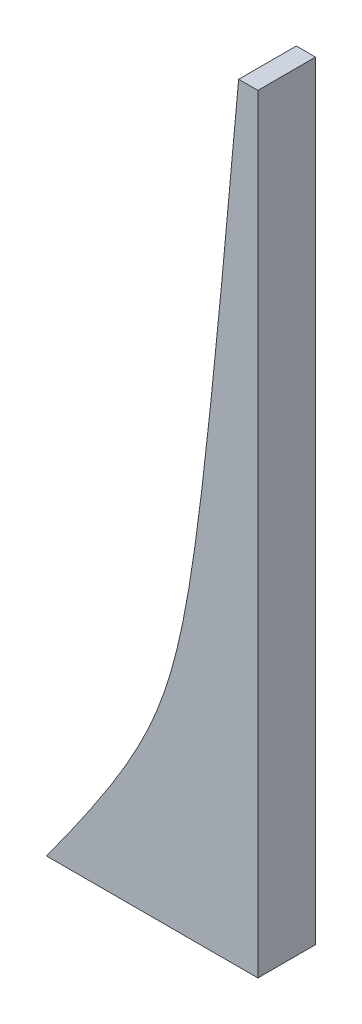
ISO-10303-21;
HEADER;
FILE_DESCRIPTION(('STEP AP214'),'2;1');
FILE_NAME('part.step','',(''),(''),'','','');
FILE_SCHEMA(('AUTOMOTIVE_DESIGN { 1 0 10303 214 1 1 1 1 }'));
ENDSEC;
DATA;
#1=APPLICATION_CONTEXT('core data for automotive mechanical design processes');
#2=APPLICATION_PROTOCOL_DEFINITION('international standard','automotive_design',2000,#1);
#3=PRODUCT_CONTEXT('',#1,'mechanical');
#4=PRODUCT('Part','Part','',(#3));
#5=PRODUCT_RELATED_PRODUCT_CATEGORY('part','',(#4));
#6=PRODUCT_DEFINITION_FORMATION('','',#4);
#7=PRODUCT_DEFINITION_CONTEXT('part definition',#1,'design');
#8=PRODUCT_DEFINITION('design','',#6,#7);
#9=PRODUCT_DEFINITION_SHAPE('','',#8);
#10=(LENGTH_UNIT() NAMED_UNIT(*) SI_UNIT(.MILLI.,.METRE.));
#11=(NAMED_UNIT(*) PLANE_ANGLE_UNIT() SI_UNIT($,.RADIAN.));
#12=(NAMED_UNIT(*) SI_UNIT($,.STERADIAN.) SOLID_ANGLE_UNIT());
#13=UNCERTAINTY_MEASURE_WITH_UNIT(LENGTH_MEASURE(1.E-05),#10,'distance_accuracy_value','');
#14=(GEOMETRIC_REPRESENTATION_CONTEXT(3) GLOBAL_UNCERTAINTY_ASSIGNED_CONTEXT((#13)) GLOBAL_UNIT_ASSIGNED_CONTEXT((#10,
#11,#12)) REPRESENTATION_CONTEXT('',''));
#15=CARTESIAN_POINT('',(0.,0.,0.));
#16=DIRECTION('',(0.,0.,1.));
#17=DIRECTION('',(1.,0.,0.));
#18=AXIS2_PLACEMENT_3D('',#15,#16,#17);
#19=CARTESIAN_POINT('',(9.99999999999999,40.,3.));
#20=CARTESIAN_POINT('',(7.33985808925216,10.0963844627478,3.));
#21=CARTESIAN_POINT('',(0.,0.,3.));
#22=(BOUNDED_CURVE() B_SPLINE_CURVE(2,(#19,#20,#21),.UNSPECIFIED.,.F.,
.F.) B_SPLINE_CURVE_WITH_KNOTS((3,3),(0.,1.),
.UNSPECIFIED.) CURVE() GEOMETRIC_REPRESENTATION_ITEM() RATIONAL_B_SPLINE_CURVE((1.,3.,1.)) REPRESENTATION_ITEM(''));
#23=DIRECTION('',(0.,0.,-1.));
#24=VECTOR('',#23,1.);
#25=SURFACE_OF_LINEAR_EXTRUSION('',#22,#24);
#26=CARTESIAN_POINT('',(9.99999999999999,40.,0.));
#27=CARTESIAN_POINT('',(7.33985808925216,10.0963844627478,0.));
#28=CARTESIAN_POINT('',(0.,0.,0.));
#29=(BOUNDED_CURVE() B_SPLINE_CURVE(2,(#26,#27,#28),.UNSPECIFIED.,.F.,
.F.) B_SPLINE_CURVE_WITH_KNOTS((3,3),(0.,1.),
.UNSPECIFIED.) CURVE() GEOMETRIC_REPRESENTATION_ITEM() RATIONAL_B_SPLINE_CURVE((1.,3.,1.)) REPRESENTATION_ITEM(''));
#30=CARTESIAN_POINT('',(9.99999999999999,40.,0.));
#31=VERTEX_POINT('',#30);
#32=CARTESIAN_POINT('',(0.,0.,0.));
#33=VERTEX_POINT('',#32);
#34=EDGE_CURVE('E96',#31,#33,#29,.T.);
#35=ORIENTED_EDGE('',*,*,#34,.T.);
#36=DIRECTION('',(0.,0.,-1.));
#37=VECTOR('',#36,1.);
#38=CARTESIAN_POINT('',(0.,0.,3.));
#39=LINE('',#38,#37);
#40=CARTESIAN_POINT('',(0.,0.,3.));
#41=VERTEX_POINT('',#40);
#42=EDGE_CURVE('E11',#41,#33,#39,.T.);
#43=ORIENTED_EDGE('',*,*,#42,.F.);
#44=CARTESIAN_POINT('',(9.99999999999999,40.,3.));
#45=VERTEX_POINT('',#44);
#46=EDGE_CURVE('E83',#45,#41,#22,.T.);
#47=ORIENTED_EDGE('',*,*,#46,.F.);
#48=DIRECTION('',(0.,0.,-1.));
#49=VECTOR('',#48,1.);
#50=CARTESIAN_POINT('',(9.99999999999999,40.,3.));
#51=LINE('',#50,#49);
#52=EDGE_CURVE('E50',#45,#31,#51,.T.);
#53=ORIENTED_EDGE('',*,*,#52,.T.);
#54=EDGE_LOOP('',(#35,#43,#47,#53));
#55=FACE_BOUND('',#54,.T.);
#56=ADVANCED_FACE('F33',(#55),#25,.F.);
#57=CARTESIAN_POINT('',(0.,0.,3.));
#58=DIRECTION('',(0.,1.,0.));
#59=DIRECTION('',(0.,0.,1.));
#60=AXIS2_PLACEMENT_3D('',#57,#58,#59);
#61=PLANE('',#60);
#62=DIRECTION('',(1.,0.,0.));
#63=VECTOR('',#62,1.);
#64=CARTESIAN_POINT('',(0.,0.,0.));
#65=LINE('',#64,#63);
#66=CARTESIAN_POINT('',(11.,0.,0.));
#67=VERTEX_POINT('',#66);
#68=EDGE_CURVE('E88',#33,#67,#65,.T.);
#69=ORIENTED_EDGE('',*,*,#68,.T.);
#70=DIRECTION('',(0.,0.,-1.));
#71=VECTOR('',#70,1.);
#72=CARTESIAN_POINT('',(11.,0.,3.));
#73=LINE('',#72,#71);
#74=CARTESIAN_POINT('',(11.,0.,3.));
#75=VERTEX_POINT('',#74);
#76=EDGE_CURVE('E42',#75,#67,#73,.T.);
#77=ORIENTED_EDGE('',*,*,#76,.F.);
#78=DIRECTION('',(1.,0.,0.));
#79=VECTOR('',#78,1.);
#80=CARTESIAN_POINT('',(0.,0.,3.));
#81=LINE('',#80,#79);
#82=EDGE_CURVE('E76',#41,#75,#81,.T.);
#83=ORIENTED_EDGE('',*,*,#82,.F.);
#84=ORIENTED_EDGE('',*,*,#42,.T.);
#85=EDGE_LOOP('',(#69,#77,#83,#84));
#86=FACE_BOUND('',#85,.T.);
#87=ADVANCED_FACE('F87',(#86),#61,.F.);
#88=CARTESIAN_POINT('',(11.,0.,3.));
#89=DIRECTION('',(-1.,0.,0.));
#90=DIRECTION('',(0.,-1.,0.));
#91=AXIS2_PLACEMENT_3D('',#88,#89,#90);
#92=PLANE('',#91);
#93=DIRECTION('',(0.,1.,0.));
#94=VECTOR('',#93,1.);
#95=CARTESIAN_POINT('',(11.,0.,0.));
#96=LINE('',#95,#94);
#97=CARTESIAN_POINT('',(11.,40.,0.));
#98=VERTEX_POINT('',#97);
#99=EDGE_CURVE('E104',#67,#98,#96,.T.);
#100=ORIENTED_EDGE('',*,*,#99,.T.);
#101=DIRECTION('',(0.,0.,-1.));
#102=VECTOR('',#101,1.);
#103=CARTESIAN_POINT('',(11.,40.,3.));
#104=LINE('',#103,#102);
#105=CARTESIAN_POINT('',(11.,40.,3.));
#106=VERTEX_POINT('',#105);
#107=EDGE_CURVE('E65',#106,#98,#104,.T.);
#108=ORIENTED_EDGE('',*,*,#107,.F.);
#109=DIRECTION('',(0.,1.,0.));
#110=VECTOR('',#109,1.);
#111=CARTESIAN_POINT('',(11.,0.,3.));
#112=LINE('',#111,#110);
#113=EDGE_CURVE('E82',#75,#106,#112,.T.);
#114=ORIENTED_EDGE('',*,*,#113,.F.);
#115=ORIENTED_EDGE('',*,*,#76,.T.);
#116=EDGE_LOOP('',(#100,#108,#114,#115));
#117=FACE_BOUND('',#116,.T.);
#118=ADVANCED_FACE('F91',(#117),#92,.F.);
#119=CARTESIAN_POINT('',(9.99999999999999,40.,3.));
#120=DIRECTION('',(0.,1.,0.));
#121=DIRECTION('',(0.,0.,1.));
#122=AXIS2_PLACEMENT_3D('',#119,#120,#121);
#123=PLANE('',#122);
#124=DIRECTION('',(1.,0.,0.));
#125=VECTOR('',#124,1.);
#126=CARTESIAN_POINT('',(9.99999999999999,40.,0.));
#127=LINE('',#126,#125);
#128=EDGE_CURVE('E106',#31,#98,#127,.T.);
#129=ORIENTED_EDGE('',*,*,#128,.F.);
#130=ORIENTED_EDGE('',*,*,#52,.F.);
#131=DIRECTION('',(1.,0.,0.));
#132=VECTOR('',#131,1.);
#133=CARTESIAN_POINT('',(9.99999999999999,40.,3.));
#134=LINE('',#133,#132);
#135=EDGE_CURVE('E92',#45,#106,#134,.T.);
#136=ORIENTED_EDGE('',*,*,#135,.T.);
#137=ORIENTED_EDGE('',*,*,#107,.T.);
#138=EDGE_LOOP('',(#129,#130,#136,#137));
#139=FACE_BOUND('',#138,.T.);
#140=ADVANCED_FACE('F118',(#139),#123,.T.);
#141=CARTESIAN_POINT('',(6.75489356693912,12.5722883470609,3.));
#142=DIRECTION('',(0.,0.,1.));
#143=DIRECTION('',(1.,0.,0.));
#144=AXIS2_PLACEMENT_3D('',#141,#142,#143);
#145=PLANE('',#144);
#146=ORIENTED_EDGE('',*,*,#46,.T.);
#147=ORIENTED_EDGE('',*,*,#82,.T.);
#148=ORIENTED_EDGE('',*,*,#113,.T.);
#149=ORIENTED_EDGE('',*,*,#135,.F.);
#150=EDGE_LOOP('',(#146,#147,#148,#149));
#151=FACE_BOUND('',#150,.T.);
#152=ADVANCED_FACE('F79',(#151),#145,.T.);
#153=CARTESIAN_POINT('',(6.75489356693912,12.5722883470609,0.));
#154=DIRECTION('',(0.,0.,1.));
#155=DIRECTION('',(1.,0.,0.));
#156=AXIS2_PLACEMENT_3D('',#153,#154,#155);
#157=PLANE('',#156);
#158=ORIENTED_EDGE('',*,*,#34,.F.);
#159=ORIENTED_EDGE('',*,*,#128,.T.);
#160=ORIENTED_EDGE('',*,*,#99,.F.);
#161=ORIENTED_EDGE('',*,*,#68,.F.);
#162=EDGE_LOOP('',(#158,#159,#160,#161));
#163=FACE_BOUND('',#162,.T.);
#164=ADVANCED_FACE('F117',(#163),#157,.F.);
#165=CLOSED_SHELL('',(#56,#87,#118,#140,#152,#164));
#166=MANIFOLD_SOLID_BREP('B2',#165);
#167=ADVANCED_BREP_SHAPE_REPRESENTATION('',(#18,#166),#14);
#168=SHAPE_DEFINITION_REPRESENTATION(#9,#167);
ENDSEC;
END-ISO-10303-21;
